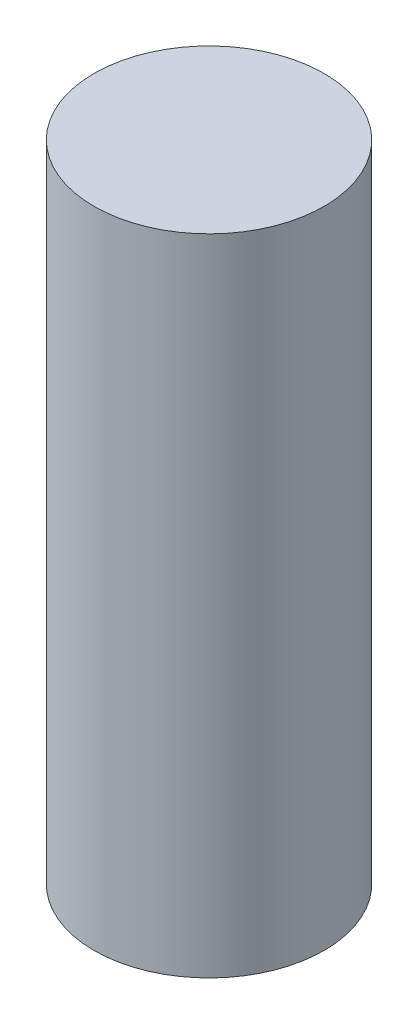
ISO-10303-21;
HEADER;
FILE_DESCRIPTION(('STEP AP214'),'2;1');
FILE_NAME('part.step','',(''),(''),'','','');
FILE_SCHEMA(('AUTOMOTIVE_DESIGN { 1 0 10303 214 1 1 1 1 }'));
ENDSEC;
DATA;
#1=APPLICATION_CONTEXT('core data for automotive mechanical design processes');
#2=APPLICATION_PROTOCOL_DEFINITION('international standard','automotive_design',2000,#1);
#3=PRODUCT_CONTEXT('',#1,'mechanical');
#4=PRODUCT('Part','Part','',(#3));
#5=PRODUCT_RELATED_PRODUCT_CATEGORY('part','',(#4));
#6=PRODUCT_DEFINITION_FORMATION('','',#4);
#7=PRODUCT_DEFINITION_CONTEXT('part definition',#1,'design');
#8=PRODUCT_DEFINITION('design','',#6,#7);
#9=PRODUCT_DEFINITION_SHAPE('','',#8);
#10=(LENGTH_UNIT() NAMED_UNIT(*) SI_UNIT(.MILLI.,.METRE.));
#11=(NAMED_UNIT(*) PLANE_ANGLE_UNIT() SI_UNIT($,.RADIAN.));
#12=(NAMED_UNIT(*) SI_UNIT($,.STERADIAN.) SOLID_ANGLE_UNIT());
#13=UNCERTAINTY_MEASURE_WITH_UNIT(LENGTH_MEASURE(1.E-05),#10,'distance_accuracy_value','');
#14=(GEOMETRIC_REPRESENTATION_CONTEXT(3) GLOBAL_UNCERTAINTY_ASSIGNED_CONTEXT((#13)) GLOBAL_UNIT_ASSIGNED_CONTEXT((#10,
#11,#12)) REPRESENTATION_CONTEXT('',''));
#15=CARTESIAN_POINT('',(0.,0.,0.));
#16=DIRECTION('',(0.,0.,1.));
#17=DIRECTION('',(1.,0.,0.));
#18=AXIS2_PLACEMENT_3D('',#15,#16,#17);
#19=CARTESIAN_POINT('',(0.,5.6,0.));
#20=DIRECTION('',(0.,-1.,0.));
#21=DIRECTION('',(0.,0.,-1.));
#22=AXIS2_PLACEMENT_3D('',#19,#20,#21);
#23=CYLINDRICAL_SURFACE('',#22,2.);
#24=CARTESIAN_POINT('',(0.,5.6,0.));
#25=DIRECTION('',(0.,1.,0.));
#26=DIRECTION('',(0.,0.,1.));
#27=AXIS2_PLACEMENT_3D('',#24,#25,#26);
#28=CIRCLE('',#27,2.);
#29=CARTESIAN_POINT('',(0.,5.6,2.));
#30=VERTEX_POINT('',#29);
#31=EDGE_CURVE('E10',#30,#30,#28,.T.);
#32=ORIENTED_EDGE('',*,*,#31,.F.);
#33=EDGE_LOOP('',(#32));
#34=FACE_BOUND('',#33,.T.);
#35=CARTESIAN_POINT('',(0.,-5.6,0.));
#36=DIRECTION('',(0.,1.,0.));
#37=DIRECTION('',(0.,0.,1.));
#38=AXIS2_PLACEMENT_3D('',#35,#36,#37);
#39=CIRCLE('',#38,2.);
#40=CARTESIAN_POINT('',(0.,-5.6,2.));
#41=VERTEX_POINT('',#40);
#42=EDGE_CURVE('E33',#41,#41,#39,.T.);
#43=ORIENTED_EDGE('',*,*,#42,.T.);
#44=EDGE_LOOP('',(#43));
#45=FACE_BOUND('',#44,.T.);
#46=ADVANCED_FACE('F30',(#34,#45),#23,.T.);
#47=CARTESIAN_POINT('',(0.,5.6,0.));
#48=DIRECTION('',(0.,1.,0.));
#49=DIRECTION('',(0.,0.,1.));
#50=AXIS2_PLACEMENT_3D('',#47,#48,#49);
#51=PLANE('',#50);
#52=ORIENTED_EDGE('',*,*,#31,.T.);
#53=EDGE_LOOP('',(#52));
#54=FACE_BOUND('',#53,.T.);
#55=ADVANCED_FACE('F45',(#54),#51,.T.);
#56=CARTESIAN_POINT('',(0.,-5.6,0.));
#57=DIRECTION('',(0.,1.,0.));
#58=DIRECTION('',(0.,0.,1.));
#59=AXIS2_PLACEMENT_3D('',#56,#57,#58);
#60=PLANE('',#59);
#61=ORIENTED_EDGE('',*,*,#42,.F.);
#62=EDGE_LOOP('',(#61));
#63=FACE_BOUND('',#62,.T.);
#64=ADVANCED_FACE('F43',(#63),#60,.F.);
#65=CLOSED_SHELL('',(#46,#55,#64));
#66=MANIFOLD_SOLID_BREP('B2',#65);
#67=ADVANCED_BREP_SHAPE_REPRESENTATION('',(#18,#66),#14);
#68=SHAPE_DEFINITION_REPRESENTATION(#9,#67);
ENDSEC;
END-ISO-10303-21;
